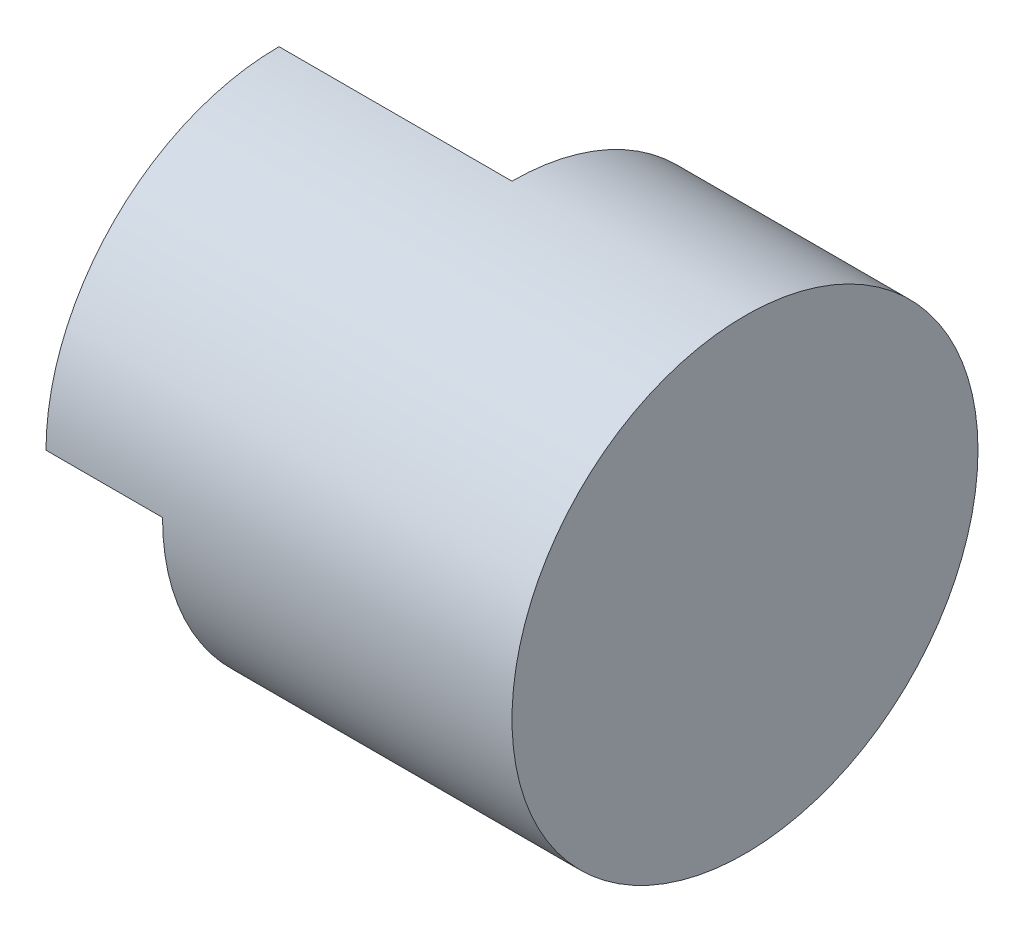
ISO-10303-21;
HEADER;
FILE_DESCRIPTION(('STEP AP214'),'2;1');
FILE_NAME('part.step','',(''),(''),'','','');
FILE_SCHEMA(('AUTOMOTIVE_DESIGN { 1 0 10303 214 1 1 1 1 }'));
ENDSEC;
DATA;
#1=APPLICATION_CONTEXT('core data for automotive mechanical design processes');
#2=APPLICATION_PROTOCOL_DEFINITION('international standard','automotive_design',2000,#1);
#3=PRODUCT_CONTEXT('',#1,'mechanical');
#4=PRODUCT('Part','Part','',(#3));
#5=PRODUCT_RELATED_PRODUCT_CATEGORY('part','',(#4));
#6=PRODUCT_DEFINITION_FORMATION('','',#4);
#7=PRODUCT_DEFINITION_CONTEXT('part definition',#1,'design');
#8=PRODUCT_DEFINITION('design','',#6,#7);
#9=PRODUCT_DEFINITION_SHAPE('','',#8);
#10=(LENGTH_UNIT() NAMED_UNIT(*) SI_UNIT(.MILLI.,.METRE.));
#11=(NAMED_UNIT(*) PLANE_ANGLE_UNIT() SI_UNIT($,.RADIAN.));
#12=(NAMED_UNIT(*) SI_UNIT($,.STERADIAN.) SOLID_ANGLE_UNIT());
#13=UNCERTAINTY_MEASURE_WITH_UNIT(LENGTH_MEASURE(1.E-05),#10,'distance_accuracy_value','');
#14=(GEOMETRIC_REPRESENTATION_CONTEXT(3) GLOBAL_UNCERTAINTY_ASSIGNED_CONTEXT((#13)) GLOBAL_UNIT_ASSIGNED_CONTEXT((#10,
#11,#12)) REPRESENTATION_CONTEXT('',''));
#15=CARTESIAN_POINT('',(0.,0.,0.));
#16=DIRECTION('',(0.,0.,1.));
#17=DIRECTION('',(1.,0.,0.));
#18=AXIS2_PLACEMENT_3D('',#15,#16,#17);
#19=CARTESIAN_POINT('',(0.,0.,-4.));
#20=DIRECTION('',(0.,-1.,0.));
#21=DIRECTION('',(0.,0.,-1.));
#22=AXIS2_PLACEMENT_3D('',#19,#20,#21);
#23=PLANE('',#22);
#24=DIRECTION('',(0.,0.,-1.));
#25=VECTOR('',#24,1.);
#26=CARTESIAN_POINT('',(-1.,0.,-2.));
#27=LINE('',#26,#25);
#28=CARTESIAN_POINT('',(-1.,0.,0.));
#29=VERTEX_POINT('',#28);
#30=CARTESIAN_POINT('',(-1.,0.,-2.));
#31=VERTEX_POINT('',#30);
#32=EDGE_CURVE('E78',#29,#31,#27,.T.);
#33=ORIENTED_EDGE('',*,*,#32,.F.);
#34=DIRECTION('',(1.,0.,0.));
#35=VECTOR('',#34,1.);
#36=CARTESIAN_POINT('',(0.,0.,0.));
#37=LINE('',#36,#35);
#38=CARTESIAN_POINT('',(0.,0.,0.));
#39=VERTEX_POINT('',#38);
#40=EDGE_CURVE('E130',#29,#39,#37,.T.);
#41=ORIENTED_EDGE('',*,*,#40,.T.);
#42=DIRECTION('',(0.,0.,1.));
#43=VECTOR('',#42,1.);
#44=CARTESIAN_POINT('',(0.,0.,-4.));
#45=LINE('',#44,#43);
#46=CARTESIAN_POINT('',(0.,0.,-2.));
#47=VERTEX_POINT('',#46);
#48=EDGE_CURVE('E93',#47,#39,#45,.T.);
#49=ORIENTED_EDGE('',*,*,#48,.F.);
#50=DIRECTION('',(-1.,0.,0.));
#51=VECTOR('',#50,1.);
#52=CARTESIAN_POINT('',(2.,0.,-2.));
#53=LINE('',#52,#51);
#54=EDGE_CURVE('E55',#31,#47,#53,.F.);
#55=ORIENTED_EDGE('',*,*,#54,.F.);
#56=EDGE_LOOP('',(#33,#41,#49,#55));
#57=FACE_BOUND('',#56,.T.);
#58=ADVANCED_FACE('F33',(#57),#23,.F.);
#59=CARTESIAN_POINT('',(2.,0.,0.));
#60=DIRECTION('',(-1.,0.,0.));
#61=DIRECTION('',(0.,0.,1.));
#62=AXIS2_PLACEMENT_3D('',#59,#60,#61);
#63=CYLINDRICAL_SURFACE('',#62,2.);
#64=CARTESIAN_POINT('',(2.,0.,0.));
#65=DIRECTION('',(1.,0.,0.));
#66=DIRECTION('',(0.,0.,-1.));
#67=AXIS2_PLACEMENT_3D('',#64,#65,#66);
#68=CIRCLE('',#67,2.);
#69=CARTESIAN_POINT('',(2.,0.,-2.));
#70=VERTEX_POINT('',#69);
#71=EDGE_CURVE('E41',#70,#70,#68,.T.);
#72=ORIENTED_EDGE('',*,*,#71,.F.);
#73=EDGE_LOOP('',(#72));
#74=FACE_BOUND('',#73,.T.);
#75=CARTESIAN_POINT('',(-2.,0.,0.));
#76=DIRECTION('',(1.,0.,0.));
#77=DIRECTION('',(0.,0.,-1.));
#78=AXIS2_PLACEMENT_3D('',#75,#76,#77);
#79=CIRCLE('',#78,2.);
#80=CARTESIAN_POINT('',(-2.,2.,0.));
#81=VERTEX_POINT('',#80);
#82=CARTESIAN_POINT('',(-2.,0.,2.));
#83=VERTEX_POINT('',#82);
#84=EDGE_CURVE('E94',#81,#83,#79,.T.);
#85=ORIENTED_EDGE('',*,*,#84,.T.);
#86=DIRECTION('',(-1.,0.,0.));
#87=VECTOR('',#86,1.);
#88=CARTESIAN_POINT('',(2.,0.,2.));
#89=LINE('',#88,#87);
#90=CARTESIAN_POINT('',(-1.,0.,2.));
#91=VERTEX_POINT('',#90);
#92=EDGE_CURVE('E88',#83,#91,#89,.F.);
#93=ORIENTED_EDGE('',*,*,#92,.T.);
#94=CARTESIAN_POINT('',(-1.,0.,0.));
#95=DIRECTION('',(-1.,0.,0.));
#96=DIRECTION('',(0.,0.,1.));
#97=AXIS2_PLACEMENT_3D('',#94,#95,#96);
#98=CIRCLE('',#97,2.);
#99=EDGE_CURVE('E80',#31,#91,#98,.T.);
#100=ORIENTED_EDGE('',*,*,#99,.F.);
#101=ORIENTED_EDGE('',*,*,#54,.T.);
#102=CARTESIAN_POINT('',(0.,0.,0.));
#103=DIRECTION('',(1.,0.,0.));
#104=DIRECTION('',(0.,0.,-1.));
#105=AXIS2_PLACEMENT_3D('',#102,#103,#104);
#106=CIRCLE('',#105,2.);
#107=CARTESIAN_POINT('',(0.,2.,0.));
#108=VERTEX_POINT('',#107);
#109=EDGE_CURVE('E11',#47,#108,#106,.T.);
#110=ORIENTED_EDGE('',*,*,#109,.T.);
#111=DIRECTION('',(-1.,0.,0.));
#112=VECTOR('',#111,1.);
#113=CARTESIAN_POINT('',(-2.,2.,0.));
#114=LINE('',#113,#112);
#115=EDGE_CURVE('E89',#108,#81,#114,.T.);
#116=ORIENTED_EDGE('',*,*,#115,.T.);
#117=EDGE_LOOP('',(#85,#93,#100,#101,#110,#116));
#118=FACE_BOUND('',#117,.T.);
#119=ADVANCED_FACE('F35',(#74,#118),#63,.T.);
#120=CARTESIAN_POINT('',(2.,0.,0.));
#121=DIRECTION('',(1.,0.,0.));
#122=DIRECTION('',(0.,0.,-1.));
#123=AXIS2_PLACEMENT_3D('',#120,#121,#122);
#124=PLANE('',#123);
#125=ORIENTED_EDGE('',*,*,#71,.T.);
#126=EDGE_LOOP('',(#125));
#127=FACE_BOUND('',#126,.T.);
#128=ADVANCED_FACE('F103',(#127),#124,.T.);
#129=CARTESIAN_POINT('',(-2.,0.,0.));
#130=DIRECTION('',(1.,0.,0.));
#131=DIRECTION('',(0.,0.,-1.));
#132=AXIS2_PLACEMENT_3D('',#129,#130,#131);
#133=PLANE('',#132);
#134=DIRECTION('',(0.,-1.,0.));
#135=VECTOR('',#134,1.);
#136=CARTESIAN_POINT('',(-2.,0.,0.));
#137=LINE('',#136,#135);
#138=CARTESIAN_POINT('',(-2.,0.,0.));
#139=VERTEX_POINT('',#138);
#140=EDGE_CURVE('E127',#81,#139,#137,.T.);
#141=ORIENTED_EDGE('',*,*,#140,.T.);
#142=DIRECTION('',(0.,0.,-1.));
#143=VECTOR('',#142,1.);
#144=CARTESIAN_POINT('',(-2.,0.,-2.));
#145=LINE('',#144,#143);
#146=EDGE_CURVE('E48',#83,#139,#145,.T.);
#147=ORIENTED_EDGE('',*,*,#146,.F.);
#148=ORIENTED_EDGE('',*,*,#84,.F.);
#149=EDGE_LOOP('',(#141,#147,#148));
#150=FACE_BOUND('',#149,.T.);
#151=ADVANCED_FACE('F110',(#150),#133,.F.);
#152=CARTESIAN_POINT('',(0.,2.,-4.));
#153=DIRECTION('',(1.,0.,0.));
#154=DIRECTION('',(0.,0.,-1.));
#155=AXIS2_PLACEMENT_3D('',#152,#153,#154);
#156=PLANE('',#155);
#157=ORIENTED_EDGE('',*,*,#48,.T.);
#158=DIRECTION('',(0.,1.,0.));
#159=VECTOR('',#158,1.);
#160=CARTESIAN_POINT('',(0.,2.,0.));
#161=LINE('',#160,#159);
#162=EDGE_CURVE('E96',#39,#108,#161,.T.);
#163=ORIENTED_EDGE('',*,*,#162,.T.);
#164=ORIENTED_EDGE('',*,*,#109,.F.);
#165=EDGE_LOOP('',(#157,#163,#164));
#166=FACE_BOUND('',#165,.T.);
#167=ADVANCED_FACE('F116',(#166),#156,.F.);
#168=CARTESIAN_POINT('',(0.,0.,0.));
#169=DIRECTION('',(0.,0.,-1.));
#170=DIRECTION('',(-1.,0.,0.));
#171=AXIS2_PLACEMENT_3D('',#168,#169,#170);
#172=PLANE('',#171);
#173=ORIENTED_EDGE('',*,*,#115,.F.);
#174=ORIENTED_EDGE('',*,*,#162,.F.);
#175=ORIENTED_EDGE('',*,*,#40,.F.);
#176=EDGE_CURVE('E132',#139,#29,#37,.T.);
#177=ORIENTED_EDGE('',*,*,#176,.F.);
#178=ORIENTED_EDGE('',*,*,#140,.F.);
#179=EDGE_LOOP('',(#173,#174,#175,#177,#178));
#180=FACE_BOUND('',#179,.T.);
#181=ADVANCED_FACE('F123',(#180),#172,.T.);
#182=CARTESIAN_POINT('',(-1.,0.,0.));
#183=DIRECTION('',(-1.,0.,0.));
#184=DIRECTION('',(0.,0.,1.));
#185=AXIS2_PLACEMENT_3D('',#182,#183,#184);
#186=PLANE('',#185);
#187=ORIENTED_EDGE('',*,*,#99,.T.);
#188=EDGE_CURVE('E82',#91,#29,#27,.T.);
#189=ORIENTED_EDGE('',*,*,#188,.T.);
#190=ORIENTED_EDGE('',*,*,#32,.T.);
#191=EDGE_LOOP('',(#187,#189,#190));
#192=FACE_BOUND('',#191,.T.);
#193=ADVANCED_FACE('F79',(#192),#186,.T.);
#194=CARTESIAN_POINT('',(-1.,0.,-2.));
#195=DIRECTION('',(0.,1.,0.));
#196=DIRECTION('',(0.,0.,1.));
#197=AXIS2_PLACEMENT_3D('',#194,#195,#196);
#198=PLANE('',#197);
#199=ORIENTED_EDGE('',*,*,#146,.T.);
#200=ORIENTED_EDGE('',*,*,#176,.T.);
#201=ORIENTED_EDGE('',*,*,#188,.F.);
#202=ORIENTED_EDGE('',*,*,#92,.F.);
#203=EDGE_LOOP('',(#199,#200,#201,#202));
#204=FACE_BOUND('',#203,.T.);
#205=ADVANCED_FACE('F141',(#204),#198,.F.);
#206=CLOSED_SHELL('',(#58,#119,#128,#151,#167,#181,#193,#205));
#207=MANIFOLD_SOLID_BREP('B2',#206);
#208=ADVANCED_BREP_SHAPE_REPRESENTATION('',(#18,#207),#14);
#209=SHAPE_DEFINITION_REPRESENTATION(#9,#208);
ENDSEC;
END-ISO-10303-21;
